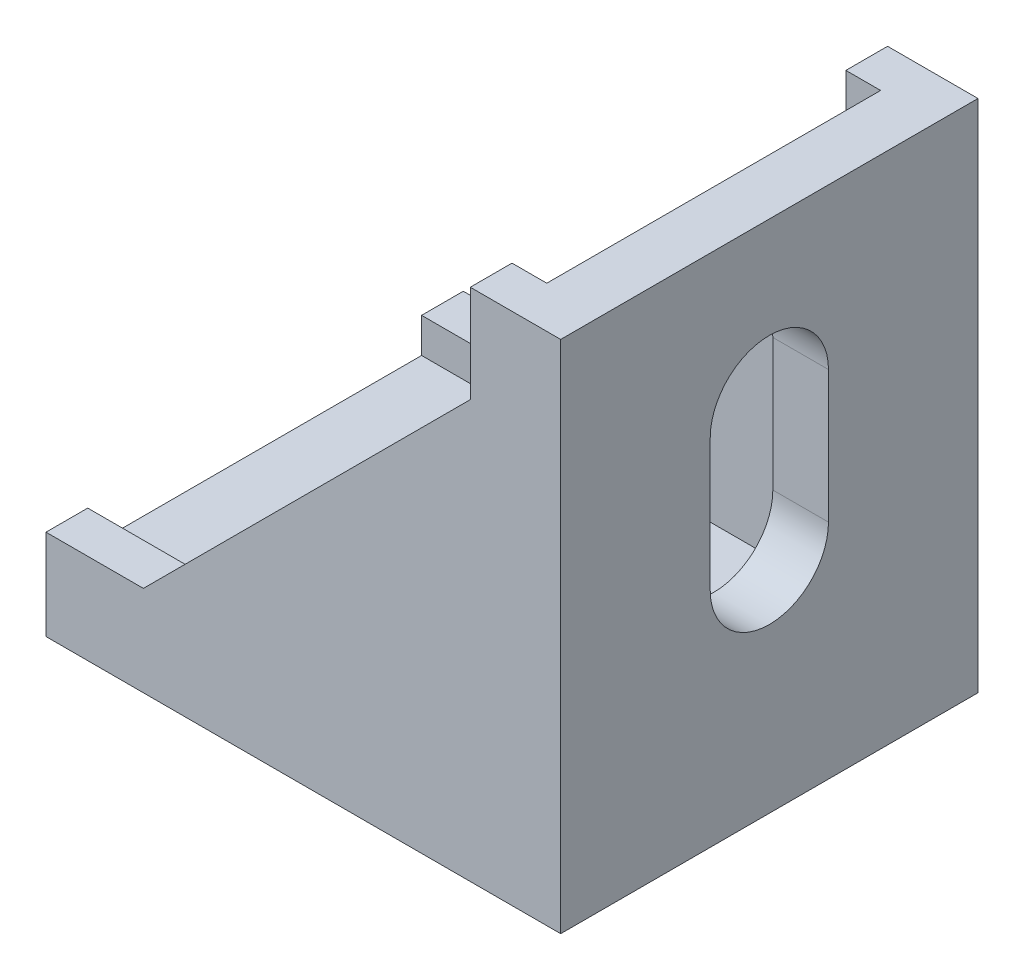
ISO-10303-21;
HEADER;
FILE_DESCRIPTION(('STEP AP214'),'2;1');
FILE_NAME('part.step','',(''),(''),'','','');
FILE_SCHEMA(('AUTOMOTIVE_DESIGN { 1 0 10303 214 1 1 1 1 }'));
ENDSEC;
DATA;
#1=APPLICATION_CONTEXT('core data for automotive mechanical design processes');
#2=APPLICATION_PROTOCOL_DEFINITION('international standard','automotive_design',2000,#1);
#3=PRODUCT_CONTEXT('',#1,'mechanical');
#4=PRODUCT('Part','Part','',(#3));
#5=PRODUCT_RELATED_PRODUCT_CATEGORY('part','',(#4));
#6=PRODUCT_DEFINITION_FORMATION('','',#4);
#7=PRODUCT_DEFINITION_CONTEXT('part definition',#1,'design');
#8=PRODUCT_DEFINITION('design','',#6,#7);
#9=PRODUCT_DEFINITION_SHAPE('','',#8);
#10=(LENGTH_UNIT() NAMED_UNIT(*) SI_UNIT(.MILLI.,.METRE.));
#11=(NAMED_UNIT(*) PLANE_ANGLE_UNIT() SI_UNIT($,.RADIAN.));
#12=(NAMED_UNIT(*) SI_UNIT($,.STERADIAN.) SOLID_ANGLE_UNIT());
#13=UNCERTAINTY_MEASURE_WITH_UNIT(LENGTH_MEASURE(1.E-05),#10,'distance_accuracy_value','');
#14=(GEOMETRIC_REPRESENTATION_CONTEXT(3) GLOBAL_UNCERTAINTY_ASSIGNED_CONTEXT((#13)) GLOBAL_UNIT_ASSIGNED_CONTEXT((#10,
#11,#12)) REPRESENTATION_CONTEXT('',''));
#15=CARTESIAN_POINT('',(0.,0.,0.));
#16=DIRECTION('',(0.,0.,1.));
#17=DIRECTION('',(1.,0.,0.));
#18=AXIS2_PLACEMENT_3D('',#15,#16,#17);
#19=CARTESIAN_POINT('',(16.3392857142857,24.2098214285714,30.));
#20=DIRECTION('',(-1.,0.,0.));
#21=DIRECTION('',(0.,0.,1.));
#22=AXIS2_PLACEMENT_3D('',#19,#20,#21);
#23=PLANE('',#22);
#24=DIRECTION('',(0.,1.,0.));
#25=VECTOR('',#24,1.);
#26=CARTESIAN_POINT('',(16.3392857142857,24.2098214285714,0.));
#27=LINE('',#26,#25);
#28=CARTESIAN_POINT('',(16.3392857142857,-12.7901785714286,0.));
#29=VERTEX_POINT('',#28);
#30=CARTESIAN_POINT('',(16.3392857142857,24.2098214285714,0.));
#31=VERTEX_POINT('',#30);
#32=EDGE_CURVE('E305',#29,#31,#27,.T.);
#33=ORIENTED_EDGE('',*,*,#32,.T.);
#34=DIRECTION('',(0.,0.,-1.));
#35=VECTOR('',#34,1.);
#36=CARTESIAN_POINT('',(16.3392857142857,24.2098214285714,30.));
#37=LINE('',#36,#35);
#38=CARTESIAN_POINT('',(16.3392857142857,24.2098214285714,30.));
#39=VERTEX_POINT('',#38);
#40=EDGE_CURVE('E333',#39,#31,#37,.T.);
#41=ORIENTED_EDGE('',*,*,#40,.F.);
#42=DIRECTION('',(0.,1.,0.));
#43=VECTOR('',#42,1.);
#44=CARTESIAN_POINT('',(16.3392857142857,24.2098214285714,30.));
#45=LINE('',#44,#43);
#46=CARTESIAN_POINT('',(16.3392857142857,-12.7901785714286,30.));
#47=VERTEX_POINT('',#46);
#48=EDGE_CURVE('E290',#47,#39,#45,.T.);
#49=ORIENTED_EDGE('',*,*,#48,.F.);
#50=DIRECTION('',(0.,0.,-1.));
#51=VECTOR('',#50,1.);
#52=CARTESIAN_POINT('',(16.3392857142857,-12.7901785714286,30.));
#53=LINE('',#52,#51);
#54=EDGE_CURVE('E336',#47,#29,#53,.T.);
#55=ORIENTED_EDGE('',*,*,#54,.T.);
#56=EDGE_LOOP('',(#33,#41,#49,#55));
#57=FACE_BOUND('',#56,.T.);
#58=CARTESIAN_POINT('',(16.3392857142861,12.7098214285714,15.));
#59=DIRECTION('',(1.,0.,0.));
#60=DIRECTION('',(0.,1.,0.));
#61=AXIS2_PLACEMENT_3D('',#58,#59,#60);
#62=CIRCLE('',#61,4.25);
#63=CARTESIAN_POINT('',(16.3392857142861,12.7098214285714,10.75));
#64=VERTEX_POINT('',#63);
#65=CARTESIAN_POINT('',(16.3392857142861,12.7098214285714,19.25));
#66=VERTEX_POINT('',#65);
#67=EDGE_CURVE('E183',#64,#66,#62,.T.);
#68=ORIENTED_EDGE('',*,*,#67,.F.);
#69=DIRECTION('',(0.,-1.,0.));
#70=VECTOR('',#69,1.);
#71=CARTESIAN_POINT('',(16.3392857142861,12.7098214285714,10.75));
#72=LINE('',#71,#70);
#73=CARTESIAN_POINT('',(16.3392857142857,3.20982142857137,10.75));
#74=VERTEX_POINT('',#73);
#75=EDGE_CURVE('E189',#64,#74,#72,.T.);
#76=ORIENTED_EDGE('',*,*,#75,.T.);
#77=CARTESIAN_POINT('',(16.339285714286,3.20982142857137,15.));
#78=DIRECTION('',(1.,0.,0.));
#79=DIRECTION('',(0.,1.,0.));
#80=AXIS2_PLACEMENT_3D('',#77,#78,#79);
#81=CIRCLE('',#80,4.25);
#82=CARTESIAN_POINT('',(16.339285714286,3.20982142857137,19.25));
#83=VERTEX_POINT('',#82);
#84=EDGE_CURVE('E193',#83,#74,#81,.T.);
#85=ORIENTED_EDGE('',*,*,#84,.F.);
#86=DIRECTION('',(0.,1.,0.));
#87=VECTOR('',#86,1.);
#88=CARTESIAN_POINT('',(16.339285714286,3.20982142857137,19.25));
#89=LINE('',#88,#87);
#90=EDGE_CURVE('E186',#83,#66,#89,.T.);
#91=ORIENTED_EDGE('',*,*,#90,.T.);
#92=EDGE_LOOP('',(#68,#76,#85,#91));
#93=FACE_BOUND('',#92,.T.);
#94=ADVANCED_FACE('F34',(#57,#93),#23,.F.);
#95=CARTESIAN_POINT('',(12.3392857142857,0.,0.));
#96=DIRECTION('',(-1.,0.,0.));
#97=DIRECTION('',(0.,-1.,0.));
#98=AXIS2_PLACEMENT_3D('',#95,#96,#97);
#99=PLANE('',#98);
#100=DIRECTION('',(0.,0.,-1.));
#101=VECTOR('',#100,1.);
#102=CARTESIAN_POINT('',(12.3392857142857,24.2098214285714,30.));
#103=LINE('',#102,#101);
#104=CARTESIAN_POINT('',(12.3392857142857,24.2098214285714,27.));
#105=VERTEX_POINT('',#104);
#106=CARTESIAN_POINT('',(12.3392857142857,24.2098214285714,2.99999999999999));
#107=VERTEX_POINT('',#106);
#108=EDGE_CURVE('E11',#105,#107,#103,.T.);
#109=ORIENTED_EDGE('',*,*,#108,.T.);
#110=DIRECTION('',(0.,-1.,0.));
#111=VECTOR('',#110,1.);
#112=CARTESIAN_POINT('',(12.3392857142857,26.4399545835836,2.99999999999999));
#113=LINE('',#112,#111);
#114=CARTESIAN_POINT('',(12.3392857142857,-8.79017857142852,3.));
#115=VERTEX_POINT('',#114);
#116=EDGE_CURVE('E246',#107,#115,#113,.T.);
#117=ORIENTED_EDGE('',*,*,#116,.T.);
#118=DIRECTION('',(0.,0.,1.));
#119=VECTOR('',#118,1.);
#120=CARTESIAN_POINT('',(12.3392857142857,-8.79017857142852,3.));
#121=LINE('',#120,#119);
#122=CARTESIAN_POINT('',(12.3392857142857,-8.79017857142851,27.));
#123=VERTEX_POINT('',#122);
#124=EDGE_CURVE('E248',#115,#123,#121,.T.);
#125=ORIENTED_EDGE('',*,*,#124,.T.);
#126=DIRECTION('',(0.,1.,0.));
#127=VECTOR('',#126,1.);
#128=CARTESIAN_POINT('',(12.3392857142857,26.4399545835836,27.));
#129=LINE('',#128,#127);
#130=EDGE_CURVE('E252',#123,#105,#129,.T.);
#131=ORIENTED_EDGE('',*,*,#130,.T.);
#132=EDGE_LOOP('',(#109,#117,#125,#131));
#133=FACE_BOUND('',#132,.T.);
#134=DIRECTION('',(0.,-1.,0.));
#135=VECTOR('',#134,1.);
#136=CARTESIAN_POINT('',(12.3392857142861,12.7098214285714,10.75));
#137=LINE('',#136,#135);
#138=CARTESIAN_POINT('',(12.3392857142857,12.7098214285714,10.75));
#139=VERTEX_POINT('',#138);
#140=CARTESIAN_POINT('',(12.3392857142859,3.20982142857143,10.75));
#141=VERTEX_POINT('',#140);
#142=EDGE_CURVE('E206',#139,#141,#137,.T.);
#143=ORIENTED_EDGE('',*,*,#142,.F.);
#144=CARTESIAN_POINT('',(12.3392857142861,12.7098214285714,15.));
#145=DIRECTION('',(1.,0.,0.));
#146=DIRECTION('',(0.,1.,0.));
#147=AXIS2_PLACEMENT_3D('',#144,#145,#146);
#148=CIRCLE('',#147,4.25);
#149=CARTESIAN_POINT('',(12.3392857142861,12.7098214285714,19.25));
#150=VERTEX_POINT('',#149);
#151=EDGE_CURVE('E57',#139,#150,#148,.T.);
#152=ORIENTED_EDGE('',*,*,#151,.T.);
#153=DIRECTION('',(0.,1.,0.));
#154=VECTOR('',#153,1.);
#155=CARTESIAN_POINT('',(12.3392857142859,3.20982142857143,19.25));
#156=LINE('',#155,#154);
#157=CARTESIAN_POINT('',(12.3392857142859,3.20982142857144,19.25));
#158=VERTEX_POINT('',#157);
#159=EDGE_CURVE('E197',#158,#150,#156,.T.);
#160=ORIENTED_EDGE('',*,*,#159,.F.);
#161=CARTESIAN_POINT('',(12.3392857142859,3.20982142857143,15.));
#162=DIRECTION('',(1.,0.,0.));
#163=DIRECTION('',(0.,1.,0.));
#164=AXIS2_PLACEMENT_3D('',#161,#162,#163);
#165=CIRCLE('',#164,4.25);
#166=EDGE_CURVE('E200',#158,#141,#165,.T.);
#167=ORIENTED_EDGE('',*,*,#166,.T.);
#168=EDGE_LOOP('',(#143,#152,#160,#167));
#169=FACE_BOUND('',#168,.T.);
#170=ADVANCED_FACE('F374',(#133,#169),#99,.T.);
#171=CARTESIAN_POINT('',(9.83928571428571,24.2098214285714,30.));
#172=DIRECTION('',(1.,0.,0.));
#173=DIRECTION('',(0.,1.,0.));
#174=AXIS2_PLACEMENT_3D('',#171,#172,#173);
#175=PLANE('',#174);
#176=DIRECTION('',(0.,0.,-1.));
#177=VECTOR('',#176,1.);
#178=CARTESIAN_POINT('',(9.83928571428572,17.2098214285714,30.));
#179=LINE('',#178,#177);
#180=CARTESIAN_POINT('',(9.83928571428572,17.2098214285714,2.99999999999999));
#181=VERTEX_POINT('',#180);
#182=CARTESIAN_POINT('',(9.83928571428572,17.2098214285714,0.));
#183=VERTEX_POINT('',#182);
#184=EDGE_CURVE('E325',#181,#183,#179,.T.);
#185=ORIENTED_EDGE('',*,*,#184,.F.);
#186=DIRECTION('',(0.,1.,0.));
#187=VECTOR('',#186,1.);
#188=CARTESIAN_POINT('',(9.83928571428571,24.2098214285714,2.99999999999999));
#189=LINE('',#188,#187);
#190=CARTESIAN_POINT('',(9.83928571428571,24.2098214285714,2.99999999999999));
#191=VERTEX_POINT('',#190);
#192=EDGE_CURVE('E277',#181,#191,#189,.T.);
#193=ORIENTED_EDGE('',*,*,#192,.T.);
#194=DIRECTION('',(0.,0.,-1.));
#195=VECTOR('',#194,1.);
#196=CARTESIAN_POINT('',(9.83928571428571,24.2098214285714,30.));
#197=LINE('',#196,#195);
#198=CARTESIAN_POINT('',(9.83928571428571,24.2098214285714,0.));
#199=VERTEX_POINT('',#198);
#200=EDGE_CURVE('E329',#191,#199,#197,.T.);
#201=ORIENTED_EDGE('',*,*,#200,.T.);
#202=DIRECTION('',(0.,-1.,0.));
#203=VECTOR('',#202,1.);
#204=CARTESIAN_POINT('',(9.83928571428571,24.2098214285714,0.));
#205=LINE('',#204,#203);
#206=EDGE_CURVE('E310',#199,#183,#205,.T.);
#207=ORIENTED_EDGE('',*,*,#206,.T.);
#208=EDGE_LOOP('',(#185,#193,#201,#207));
#209=FACE_BOUND('',#208,.T.);
#210=ADVANCED_FACE('F382',(#209),#175,.F.);
#211=CARTESIAN_POINT('',(-13.6607142857143,-6.29017857142856,30.));
#212=DIRECTION('',(0.707106781186547,-0.707106781186548,0.));
#213=DIRECTION('',(0.707106781186548,0.707106781186547,0.));
#214=AXIS2_PLACEMENT_3D('',#211,#212,#213);
#215=PLANE('',#214);
#216=DIRECTION('',(0.,0.,-1.));
#217=VECTOR('',#216,1.);
#218=CARTESIAN_POINT('',(-13.6607142857143,-6.29017857142856,30.));
#219=LINE('',#218,#217);
#220=CARTESIAN_POINT('',(-13.6607142857143,-6.29017857142856,3.));
#221=VERTEX_POINT('',#220);
#222=CARTESIAN_POINT('',(-13.6607142857143,-6.29017857142856,0.));
#223=VERTEX_POINT('',#222);
#224=EDGE_CURVE('E321',#221,#223,#219,.T.);
#225=ORIENTED_EDGE('',*,*,#224,.F.);
#226=DIRECTION('',(0.707106781186548,0.707106781186547,0.));
#227=VECTOR('',#226,1.);
#228=CARTESIAN_POINT('',(-13.6607142857143,-6.29017857142857,3.));
#229=LINE('',#228,#227);
#230=EDGE_CURVE('E274',#221,#181,#229,.T.);
#231=ORIENTED_EDGE('',*,*,#230,.T.);
#232=ORIENTED_EDGE('',*,*,#184,.T.);
#233=DIRECTION('',(-0.707106781186548,-0.707106781186547,0.));
#234=VECTOR('',#233,1.);
#235=CARTESIAN_POINT('',(-13.6607142857143,-6.29017857142856,0.));
#236=LINE('',#235,#234);
#237=EDGE_CURVE('E313',#183,#223,#236,.T.);
#238=ORIENTED_EDGE('',*,*,#237,.T.);
#239=EDGE_LOOP('',(#225,#231,#232,#238));
#240=FACE_BOUND('',#239,.T.);
#241=ADVANCED_FACE('F352',(#240),#215,.F.);
#242=CARTESIAN_POINT('',(-20.6607142857143,-6.29017857142856,30.));
#243=DIRECTION('',(0.,-1.,0.));
#244=DIRECTION('',(1.,0.,0.));
#245=AXIS2_PLACEMENT_3D('',#242,#243,#244);
#246=PLANE('',#245);
#247=DIRECTION('',(0.,0.,-1.));
#248=VECTOR('',#247,1.);
#249=CARTESIAN_POINT('',(-20.6607142857143,-6.29017857142856,30.));
#250=LINE('',#249,#248);
#251=CARTESIAN_POINT('',(-20.6607142857143,-6.29017857142856,3.));
#252=VERTEX_POINT('',#251);
#253=CARTESIAN_POINT('',(-20.6607142857143,-6.29017857142856,0.));
#254=VERTEX_POINT('',#253);
#255=EDGE_CURVE('E300',#252,#254,#250,.T.);
#256=ORIENTED_EDGE('',*,*,#255,.F.);
#257=DIRECTION('',(1.,0.,0.));
#258=VECTOR('',#257,1.);
#259=CARTESIAN_POINT('',(-20.6607142857143,-6.29017857142856,3.));
#260=LINE('',#259,#258);
#261=EDGE_CURVE('E42',#252,#221,#260,.T.);
#262=ORIENTED_EDGE('',*,*,#261,.T.);
#263=ORIENTED_EDGE('',*,*,#224,.T.);
#264=DIRECTION('',(-1.,0.,0.));
#265=VECTOR('',#264,1.);
#266=CARTESIAN_POINT('',(-20.6607142857143,-6.29017857142856,0.));
#267=LINE('',#266,#265);
#268=EDGE_CURVE('E288',#223,#254,#267,.T.);
#269=ORIENTED_EDGE('',*,*,#268,.T.);
#270=EDGE_LOOP('',(#256,#262,#263,#269));
#271=FACE_BOUND('',#270,.T.);
#272=ADVANCED_FACE('F348',(#271),#246,.F.);
#273=CARTESIAN_POINT('',(-20.6607142857143,-12.7901785714286,30.));
#274=DIRECTION('',(1.,0.,0.));
#275=DIRECTION('',(0.,1.,0.));
#276=AXIS2_PLACEMENT_3D('',#273,#274,#275);
#277=PLANE('',#276);
#278=DIRECTION('',(0.,0.,1.));
#279=VECTOR('',#278,1.);
#280=CARTESIAN_POINT('',(-20.6607142857143,-8.79017857142857,3.));
#281=LINE('',#280,#279);
#282=CARTESIAN_POINT('',(-20.6607142857143,-8.79017857142857,3.));
#283=VERTEX_POINT('',#282);
#284=CARTESIAN_POINT('',(-20.6607142857143,-8.79017857142857,27.));
#285=VERTEX_POINT('',#284);
#286=EDGE_CURVE('E257',#283,#285,#281,.T.);
#287=ORIENTED_EDGE('',*,*,#286,.F.);
#288=DIRECTION('',(0.,-1.,0.));
#289=VECTOR('',#288,1.);
#290=CARTESIAN_POINT('',(-20.6607142857143,26.4399545835836,2.99999999999999));
#291=LINE('',#290,#289);
#292=EDGE_CURVE('E239',#252,#283,#291,.T.);
#293=ORIENTED_EDGE('',*,*,#292,.F.);
#294=ORIENTED_EDGE('',*,*,#255,.T.);
#295=DIRECTION('',(0.,-1.,0.));
#296=VECTOR('',#295,1.);
#297=CARTESIAN_POINT('',(-20.6607142857143,-12.7901785714286,0.));
#298=LINE('',#297,#296);
#299=CARTESIAN_POINT('',(-20.6607142857143,-12.7901785714286,0.));
#300=VERTEX_POINT('',#299);
#301=EDGE_CURVE('E283',#254,#300,#298,.T.);
#302=ORIENTED_EDGE('',*,*,#301,.T.);
#303=DIRECTION('',(0.,0.,-1.));
#304=VECTOR('',#303,1.);
#305=CARTESIAN_POINT('',(-20.6607142857143,-12.7901785714286,30.));
#306=LINE('',#305,#304);
#307=CARTESIAN_POINT('',(-20.6607142857143,-12.7901785714286,30.));
#308=VERTEX_POINT('',#307);
#309=EDGE_CURVE('E339',#308,#300,#306,.T.);
#310=ORIENTED_EDGE('',*,*,#309,.F.);
#311=DIRECTION('',(0.,-1.,0.));
#312=VECTOR('',#311,1.);
#313=CARTESIAN_POINT('',(-20.6607142857143,-12.7901785714286,30.));
#314=LINE('',#313,#312);
#315=CARTESIAN_POINT('',(-20.6607142857143,-6.29017857142856,30.));
#316=VERTEX_POINT('',#315);
#317=EDGE_CURVE('E284',#316,#308,#314,.T.);
#318=ORIENTED_EDGE('',*,*,#317,.F.);
#319=CARTESIAN_POINT('',(-20.6607142857143,-6.29017857142856,27.));
#320=VERTEX_POINT('',#319);
#321=EDGE_CURVE('E318',#316,#320,#250,.T.);
#322=ORIENTED_EDGE('',*,*,#321,.T.);
#323=DIRECTION('',(0.,1.,0.));
#324=VECTOR('',#323,1.);
#325=CARTESIAN_POINT('',(-20.6607142857143,26.4399545835836,27.));
#326=LINE('',#325,#324);
#327=EDGE_CURVE('E249',#285,#320,#326,.T.);
#328=ORIENTED_EDGE('',*,*,#327,.F.);
#329=EDGE_LOOP('',(#287,#293,#294,#302,#310,#318,#322,#328));
#330=FACE_BOUND('',#329,.T.);
#331=ADVANCED_FACE('F36',(#330),#277,.F.);
#332=CARTESIAN_POINT('',(-20.6607142857143,-12.7901785714286,30.));
#333=DIRECTION('',(0.,1.,0.));
#334=DIRECTION('',(0.,0.,1.));
#335=AXIS2_PLACEMENT_3D('',#332,#333,#334);
#336=PLANE('',#335);
#337=DIRECTION('',(1.,0.,0.));
#338=VECTOR('',#337,1.);
#339=CARTESIAN_POINT('',(-9.16071428571423,-12.7901785714286,10.75));
#340=LINE('',#339,#338);
#341=CARTESIAN_POINT('',(-9.16071428571423,-12.7901785714286,10.75));
#342=VERTEX_POINT('',#341);
#343=CARTESIAN_POINT('',(0.339285714285771,-12.7901785714286,10.75));
#344=VERTEX_POINT('',#343);
#345=EDGE_CURVE('E225',#342,#344,#340,.T.);
#346=ORIENTED_EDGE('',*,*,#345,.F.);
#347=CARTESIAN_POINT('',(-9.16071428571423,-12.7901785714286,15.));
#348=DIRECTION('',(0.,1.,0.));
#349=DIRECTION('',(-1.,0.,0.));
#350=AXIS2_PLACEMENT_3D('',#347,#348,#349);
#351=CIRCLE('',#350,4.25);
#352=CARTESIAN_POINT('',(-9.16071428571423,-12.7901785714286,19.25));
#353=VERTEX_POINT('',#352);
#354=EDGE_CURVE('E216',#342,#353,#351,.T.);
#355=ORIENTED_EDGE('',*,*,#354,.T.);
#356=DIRECTION('',(-1.,0.,0.));
#357=VECTOR('',#356,1.);
#358=CARTESIAN_POINT('',(0.339285714285771,-12.7901785714286,19.25));
#359=LINE('',#358,#357);
#360=CARTESIAN_POINT('',(0.339285714285768,-12.7901785714286,19.25));
#361=VERTEX_POINT('',#360);
#362=EDGE_CURVE('E219',#361,#353,#359,.T.);
#363=ORIENTED_EDGE('',*,*,#362,.F.);
#364=CARTESIAN_POINT('',(0.339285714285771,-12.7901785714286,15.));
#365=DIRECTION('',(0.,1.,0.));
#366=DIRECTION('',(-1.,0.,0.));
#367=AXIS2_PLACEMENT_3D('',#364,#365,#366);
#368=CIRCLE('',#367,4.25);
#369=EDGE_CURVE('E222',#361,#344,#368,.T.);
#370=ORIENTED_EDGE('',*,*,#369,.T.);
#371=EDGE_LOOP('',(#346,#355,#363,#370));
#372=FACE_BOUND('',#371,.T.);
#373=DIRECTION('',(1.,0.,0.));
#374=VECTOR('',#373,1.);
#375=CARTESIAN_POINT('',(-20.6607142857143,-12.7901785714286,0.));
#376=LINE('',#375,#374);
#377=EDGE_CURVE('E303',#300,#29,#376,.T.);
#378=ORIENTED_EDGE('',*,*,#377,.T.);
#379=ORIENTED_EDGE('',*,*,#54,.F.);
#380=DIRECTION('',(1.,0.,0.));
#381=VECTOR('',#380,1.);
#382=CARTESIAN_POINT('',(-20.6607142857143,-12.7901785714286,30.));
#383=LINE('',#382,#381);
#384=EDGE_CURVE('E287',#308,#47,#383,.T.);
#385=ORIENTED_EDGE('',*,*,#384,.F.);
#386=ORIENTED_EDGE('',*,*,#309,.T.);
#387=EDGE_LOOP('',(#378,#379,#385,#386));
#388=FACE_BOUND('',#387,.T.);
#389=ADVANCED_FACE('F394',(#372,#388),#336,.F.);
#390=CARTESIAN_POINT('',(16.3392857142857,24.2098214285714,30.));
#391=DIRECTION('',(0.,-1.,0.));
#392=DIRECTION('',(0.,0.,-1.));
#393=AXIS2_PLACEMENT_3D('',#390,#391,#392);
#394=PLANE('',#393);
#395=ORIENTED_EDGE('',*,*,#200,.F.);
#396=DIRECTION('',(1.,0.,0.));
#397=VECTOR('',#396,1.);
#398=CARTESIAN_POINT('',(16.3392857142857,24.2098214285714,2.99999999999999));
#399=LINE('',#398,#397);
#400=EDGE_CURVE('E280',#191,#107,#399,.T.);
#401=ORIENTED_EDGE('',*,*,#400,.T.);
#402=ORIENTED_EDGE('',*,*,#108,.F.);
#403=DIRECTION('',(-1.,0.,0.));
#404=VECTOR('',#403,1.);
#405=CARTESIAN_POINT('',(16.3392857142857,24.2098214285714,27.));
#406=LINE('',#405,#404);
#407=CARTESIAN_POINT('',(9.83928571428571,24.2098214285714,27.));
#408=VERTEX_POINT('',#407);
#409=EDGE_CURVE('E271',#105,#408,#406,.T.);
#410=ORIENTED_EDGE('',*,*,#409,.T.);
#411=CARTESIAN_POINT('',(9.83928571428571,24.2098214285714,30.));
#412=VERTEX_POINT('',#411);
#413=EDGE_CURVE('E330',#412,#408,#197,.T.);
#414=ORIENTED_EDGE('',*,*,#413,.F.);
#415=DIRECTION('',(-1.,0.,0.));
#416=VECTOR('',#415,1.);
#417=CARTESIAN_POINT('',(16.3392857142857,24.2098214285714,30.));
#418=LINE('',#417,#416);
#419=EDGE_CURVE('E292',#39,#412,#418,.T.);
#420=ORIENTED_EDGE('',*,*,#419,.F.);
#421=ORIENTED_EDGE('',*,*,#40,.T.);
#422=DIRECTION('',(-1.,0.,0.));
#423=VECTOR('',#422,1.);
#424=CARTESIAN_POINT('',(16.3392857142857,24.2098214285714,0.));
#425=LINE('',#424,#423);
#426=EDGE_CURVE('E307',#31,#199,#425,.T.);
#427=ORIENTED_EDGE('',*,*,#426,.T.);
#428=EDGE_LOOP('',(#395,#401,#402,#410,#414,#420,#421,#427));
#429=FACE_BOUND('',#428,.T.);
#430=ADVANCED_FACE('F379',(#429),#394,.F.);
#431=ORIENTED_EDGE('',*,*,#413,.T.);
#432=DIRECTION('',(0.,-1.,0.));
#433=VECTOR('',#432,1.);
#434=CARTESIAN_POINT('',(9.83928571428571,24.2098214285714,27.));
#435=LINE('',#434,#433);
#436=CARTESIAN_POINT('',(9.83928571428572,17.2098214285714,27.));
#437=VERTEX_POINT('',#436);
#438=EDGE_CURVE('E268',#408,#437,#435,.T.);
#439=ORIENTED_EDGE('',*,*,#438,.T.);
#440=CARTESIAN_POINT('',(9.83928571428572,17.2098214285714,30.));
#441=VERTEX_POINT('',#440);
#442=EDGE_CURVE('E326',#441,#437,#179,.T.);
#443=ORIENTED_EDGE('',*,*,#442,.F.);
#444=DIRECTION('',(0.,-1.,0.));
#445=VECTOR('',#444,1.);
#446=CARTESIAN_POINT('',(9.83928571428571,24.2098214285714,30.));
#447=LINE('',#446,#445);
#448=EDGE_CURVE('E294',#412,#441,#447,.T.);
#449=ORIENTED_EDGE('',*,*,#448,.F.);
#450=EDGE_LOOP('',(#431,#439,#443,#449));
#451=FACE_BOUND('',#450,.T.);
#452=ADVANCED_FACE('F401',(#451),#175,.F.);
#453=ORIENTED_EDGE('',*,*,#442,.T.);
#454=DIRECTION('',(-0.707106781186548,-0.707106781186547,0.));
#455=VECTOR('',#454,1.);
#456=CARTESIAN_POINT('',(-13.6607142857143,-6.29017857142856,27.));
#457=LINE('',#456,#455);
#458=CARTESIAN_POINT('',(-13.6607142857143,-6.29017857142856,27.));
#459=VERTEX_POINT('',#458);
#460=EDGE_CURVE('E263',#437,#459,#457,.T.);
#461=ORIENTED_EDGE('',*,*,#460,.T.);
#462=CARTESIAN_POINT('',(-13.6607142857143,-6.29017857142856,30.));
#463=VERTEX_POINT('',#462);
#464=EDGE_CURVE('E322',#463,#459,#219,.T.);
#465=ORIENTED_EDGE('',*,*,#464,.F.);
#466=DIRECTION('',(-0.707106781186548,-0.707106781186547,0.));
#467=VECTOR('',#466,1.);
#468=CARTESIAN_POINT('',(-13.6607142857143,-6.29017857142856,30.));
#469=LINE('',#468,#467);
#470=EDGE_CURVE('E296',#441,#463,#469,.T.);
#471=ORIENTED_EDGE('',*,*,#470,.F.);
#472=EDGE_LOOP('',(#453,#461,#465,#471));
#473=FACE_BOUND('',#472,.T.);
#474=ADVANCED_FACE('F413',(#473),#215,.F.);
#475=ORIENTED_EDGE('',*,*,#464,.T.);
#476=DIRECTION('',(-1.,0.,0.));
#477=VECTOR('',#476,1.);
#478=CARTESIAN_POINT('',(-20.6607142857143,-6.29017857142856,27.));
#479=LINE('',#478,#477);
#480=EDGE_CURVE('E342',#459,#320,#479,.T.);
#481=ORIENTED_EDGE('',*,*,#480,.T.);
#482=ORIENTED_EDGE('',*,*,#321,.F.);
#483=DIRECTION('',(-1.,0.,0.));
#484=VECTOR('',#483,1.);
#485=CARTESIAN_POINT('',(-20.6607142857143,-6.29017857142856,30.));
#486=LINE('',#485,#484);
#487=EDGE_CURVE('E298',#463,#316,#486,.T.);
#488=ORIENTED_EDGE('',*,*,#487,.F.);
#489=EDGE_LOOP('',(#475,#481,#482,#488));
#490=FACE_BOUND('',#489,.T.);
#491=ADVANCED_FACE('F417',(#490),#246,.F.);
#492=CARTESIAN_POINT('',(0.,0.,30.));
#493=DIRECTION('',(0.,0.,-1.));
#494=DIRECTION('',(-1.,0.,0.));
#495=AXIS2_PLACEMENT_3D('',#492,#493,#494);
#496=PLANE('',#495);
#497=ORIENTED_EDGE('',*,*,#317,.T.);
#498=ORIENTED_EDGE('',*,*,#384,.T.);
#499=ORIENTED_EDGE('',*,*,#48,.T.);
#500=ORIENTED_EDGE('',*,*,#419,.T.);
#501=ORIENTED_EDGE('',*,*,#448,.T.);
#502=ORIENTED_EDGE('',*,*,#470,.T.);
#503=ORIENTED_EDGE('',*,*,#487,.T.);
#504=EDGE_LOOP('',(#497,#498,#499,#500,#501,#502,#503));
#505=FACE_BOUND('',#504,.T.);
#506=ADVANCED_FACE('F391',(#505),#496,.F.);
#507=CARTESIAN_POINT('',(0.,0.,0.));
#508=DIRECTION('',(0.,0.,-1.));
#509=DIRECTION('',(-1.,0.,0.));
#510=AXIS2_PLACEMENT_3D('',#507,#508,#509);
#511=PLANE('',#510);
#512=ORIENTED_EDGE('',*,*,#301,.F.);
#513=ORIENTED_EDGE('',*,*,#268,.F.);
#514=ORIENTED_EDGE('',*,*,#237,.F.);
#515=ORIENTED_EDGE('',*,*,#206,.F.);
#516=ORIENTED_EDGE('',*,*,#426,.F.);
#517=ORIENTED_EDGE('',*,*,#32,.F.);
#518=ORIENTED_EDGE('',*,*,#377,.F.);
#519=EDGE_LOOP('',(#512,#513,#514,#515,#516,#517,#518));
#520=FACE_BOUND('',#519,.T.);
#521=ADVANCED_FACE('F359',(#520),#511,.T.);
#522=CARTESIAN_POINT('',(12.3392857142857,26.4399545835836,2.99999999999999));
#523=DIRECTION('',(0.,0.,-1.));
#524=DIRECTION('',(0.,1.,0.));
#525=AXIS2_PLACEMENT_3D('',#522,#523,#524);
#526=PLANE('',#525);
#527=ORIENTED_EDGE('',*,*,#192,.F.);
#528=ORIENTED_EDGE('',*,*,#230,.F.);
#529=ORIENTED_EDGE('',*,*,#261,.F.);
#530=ORIENTED_EDGE('',*,*,#292,.T.);
#531=DIRECTION('',(-1.,0.,0.));
#532=VECTOR('',#531,1.);
#533=CARTESIAN_POINT('',(12.3392857142857,-8.79017857142852,3.));
#534=LINE('',#533,#532);
#535=EDGE_CURVE('E255',#115,#283,#534,.T.);
#536=ORIENTED_EDGE('',*,*,#535,.F.);
#537=ORIENTED_EDGE('',*,*,#116,.F.);
#538=ORIENTED_EDGE('',*,*,#400,.F.);
#539=EDGE_LOOP('',(#527,#528,#529,#530,#536,#537,#538));
#540=FACE_BOUND('',#539,.T.);
#541=ADVANCED_FACE('F367',(#540),#526,.F.);
#542=CARTESIAN_POINT('',(12.3392857142857,26.4399545835836,27.));
#543=DIRECTION('',(0.,0.,1.));
#544=DIRECTION('',(0.,-1.,0.));
#545=AXIS2_PLACEMENT_3D('',#542,#543,#544);
#546=PLANE('',#545);
#547=ORIENTED_EDGE('',*,*,#130,.F.);
#548=DIRECTION('',(-1.,0.,0.));
#549=VECTOR('',#548,1.);
#550=CARTESIAN_POINT('',(12.3392857142857,-8.79017857142851,27.));
#551=LINE('',#550,#549);
#552=EDGE_CURVE('E261',#123,#285,#551,.T.);
#553=ORIENTED_EDGE('',*,*,#552,.T.);
#554=ORIENTED_EDGE('',*,*,#327,.T.);
#555=ORIENTED_EDGE('',*,*,#480,.F.);
#556=ORIENTED_EDGE('',*,*,#460,.F.);
#557=ORIENTED_EDGE('',*,*,#438,.F.);
#558=ORIENTED_EDGE('',*,*,#409,.F.);
#559=EDGE_LOOP('',(#547,#553,#554,#555,#556,#557,#558));
#560=FACE_BOUND('',#559,.T.);
#561=ADVANCED_FACE('F428',(#560),#546,.F.);
#562=CARTESIAN_POINT('',(12.3392857142857,-8.79017857142852,3.));
#563=DIRECTION('',(0.,-1.,0.));
#564=DIRECTION('',(1.,0.,0.));
#565=AXIS2_PLACEMENT_3D('',#562,#563,#564);
#566=PLANE('',#565);
#567=DIRECTION('',(-1.,0.,0.));
#568=VECTOR('',#567,1.);
#569=CARTESIAN_POINT('',(0.339285714285764,-8.79017857142853,19.25));
#570=LINE('',#569,#568);
#571=CARTESIAN_POINT('',(0.339285714285764,-8.79017857142853,19.25));
#572=VERTEX_POINT('',#571);
#573=CARTESIAN_POINT('',(-9.16071428571423,-8.79017857142855,19.25));
#574=VERTEX_POINT('',#573);
#575=EDGE_CURVE('E229',#572,#574,#570,.T.);
#576=ORIENTED_EDGE('',*,*,#575,.T.);
#577=CARTESIAN_POINT('',(-9.16071428571423,-8.79017857142855,15.));
#578=DIRECTION('',(0.,1.,0.));
#579=DIRECTION('',(-1.,0.,0.));
#580=AXIS2_PLACEMENT_3D('',#577,#578,#579);
#581=CIRCLE('',#580,4.25);
#582=CARTESIAN_POINT('',(-9.16071428571423,-8.79017857142855,10.75));
#583=VERTEX_POINT('',#582);
#584=EDGE_CURVE('E212',#583,#574,#581,.T.);
#585=ORIENTED_EDGE('',*,*,#584,.F.);
#586=DIRECTION('',(1.,0.,0.));
#587=VECTOR('',#586,1.);
#588=CARTESIAN_POINT('',(-9.16071428571423,-8.79017857142855,10.75));
#589=LINE('',#588,#587);
#590=CARTESIAN_POINT('',(0.339285714285764,-8.79017857142853,10.75));
#591=VERTEX_POINT('',#590);
#592=EDGE_CURVE('E220',#583,#591,#589,.T.);
#593=ORIENTED_EDGE('',*,*,#592,.T.);
#594=CARTESIAN_POINT('',(0.339285714285764,-8.79017857142853,15.));
#595=DIRECTION('',(0.,1.,0.));
#596=DIRECTION('',(-1.,0.,0.));
#597=AXIS2_PLACEMENT_3D('',#594,#595,#596);
#598=CIRCLE('',#597,4.25);
#599=EDGE_CURVE('E232',#572,#591,#598,.T.);
#600=ORIENTED_EDGE('',*,*,#599,.F.);
#601=EDGE_LOOP('',(#576,#585,#593,#600));
#602=FACE_BOUND('',#601,.T.);
#603=ORIENTED_EDGE('',*,*,#286,.T.);
#604=ORIENTED_EDGE('',*,*,#552,.F.);
#605=ORIENTED_EDGE('',*,*,#124,.F.);
#606=ORIENTED_EDGE('',*,*,#535,.T.);
#607=EDGE_LOOP('',(#603,#604,#605,#606));
#608=FACE_BOUND('',#607,.T.);
#609=ADVANCED_FACE('F371',(#602,#608),#566,.F.);
#610=CARTESIAN_POINT('',(-9.16071428571423,-12.7901785714286,15.));
#611=DIRECTION('',(0.,1.,0.));
#612=DIRECTION('',(-1.,0.,0.));
#613=AXIS2_PLACEMENT_3D('',#610,#611,#612);
#614=CYLINDRICAL_SURFACE('',#613,4.25);
#615=ORIENTED_EDGE('',*,*,#584,.T.);
#616=DIRECTION('',(0.,1.,0.));
#617=VECTOR('',#616,1.);
#618=CARTESIAN_POINT('',(-9.16071428571423,-12.7901785714286,19.25));
#619=LINE('',#618,#617);
#620=EDGE_CURVE('E227',#353,#574,#619,.T.);
#621=ORIENTED_EDGE('',*,*,#620,.F.);
#622=ORIENTED_EDGE('',*,*,#354,.F.);
#623=DIRECTION('',(0.,1.,0.));
#624=VECTOR('',#623,1.);
#625=CARTESIAN_POINT('',(-9.16071428571423,-12.7901785714286,10.75));
#626=LINE('',#625,#624);
#627=EDGE_CURVE('E237',#342,#583,#626,.T.);
#628=ORIENTED_EDGE('',*,*,#627,.T.);
#629=EDGE_LOOP('',(#615,#621,#622,#628));
#630=FACE_BOUND('',#629,.T.);
#631=ADVANCED_FACE('F431',(#630),#614,.F.);
#632=CARTESIAN_POINT('',(-9.16071428571423,-12.7901785714286,10.75));
#633=DIRECTION('',(0.,0.,1.));
#634=DIRECTION('',(0.,-1.,0.));
#635=AXIS2_PLACEMENT_3D('',#632,#633,#634);
#636=PLANE('',#635);
#637=ORIENTED_EDGE('',*,*,#592,.F.);
#638=ORIENTED_EDGE('',*,*,#627,.F.);
#639=ORIENTED_EDGE('',*,*,#345,.T.);
#640=DIRECTION('',(0.,1.,0.));
#641=VECTOR('',#640,1.);
#642=CARTESIAN_POINT('',(0.339285714285771,-12.7901785714286,10.75));
#643=LINE('',#642,#641);
#644=EDGE_CURVE('E240',#344,#591,#643,.T.);
#645=ORIENTED_EDGE('',*,*,#644,.T.);
#646=EDGE_LOOP('',(#637,#638,#639,#645));
#647=FACE_BOUND('',#646,.T.);
#648=ADVANCED_FACE('F438',(#647),#636,.T.);
#649=CARTESIAN_POINT('',(0.339285714285771,-12.7901785714286,15.));
#650=DIRECTION('',(0.,1.,0.));
#651=DIRECTION('',(-1.,0.,0.));
#652=AXIS2_PLACEMENT_3D('',#649,#650,#651);
#653=CYLINDRICAL_SURFACE('',#652,4.25);
#654=ORIENTED_EDGE('',*,*,#599,.T.);
#655=ORIENTED_EDGE('',*,*,#644,.F.);
#656=ORIENTED_EDGE('',*,*,#369,.F.);
#657=DIRECTION('',(0.,1.,0.));
#658=VECTOR('',#657,1.);
#659=CARTESIAN_POINT('',(0.33928571428577,-12.7901785714286,19.25));
#660=LINE('',#659,#658);
#661=EDGE_CURVE('E242',#361,#572,#660,.T.);
#662=ORIENTED_EDGE('',*,*,#661,.T.);
#663=EDGE_LOOP('',(#654,#655,#656,#662));
#664=FACE_BOUND('',#663,.T.);
#665=ADVANCED_FACE('F443',(#664),#653,.F.);
#666=CARTESIAN_POINT('',(0.339285714285771,-12.7901785714286,19.25));
#667=DIRECTION('',(0.,0.,-1.));
#668=DIRECTION('',(0.,1.,0.));
#669=AXIS2_PLACEMENT_3D('',#666,#667,#668);
#670=PLANE('',#669);
#671=ORIENTED_EDGE('',*,*,#575,.F.);
#672=ORIENTED_EDGE('',*,*,#661,.F.);
#673=ORIENTED_EDGE('',*,*,#362,.T.);
#674=ORIENTED_EDGE('',*,*,#620,.T.);
#675=EDGE_LOOP('',(#671,#672,#673,#674));
#676=FACE_BOUND('',#675,.T.);
#677=ADVANCED_FACE('F440',(#676),#670,.T.);
#678=CARTESIAN_POINT('',(16.3392857142861,12.7098214285714,15.));
#679=DIRECTION('',(-1.,0.,0.));
#680=DIRECTION('',(0.,-1.,0.));
#681=AXIS2_PLACEMENT_3D('',#678,#679,#680);
#682=CYLINDRICAL_SURFACE('',#681,4.25);
#683=ORIENTED_EDGE('',*,*,#151,.F.);
#684=DIRECTION('',(-1.,0.,0.));
#685=VECTOR('',#684,1.);
#686=CARTESIAN_POINT('',(16.3392857142861,12.7098214285714,10.75));
#687=LINE('',#686,#685);
#688=EDGE_CURVE('E180',#64,#139,#687,.T.);
#689=ORIENTED_EDGE('',*,*,#688,.F.);
#690=ORIENTED_EDGE('',*,*,#67,.T.);
#691=DIRECTION('',(-1.,0.,0.));
#692=VECTOR('',#691,1.);
#693=CARTESIAN_POINT('',(16.3392857142861,12.7098214285714,19.25));
#694=LINE('',#693,#692);
#695=EDGE_CURVE('E210',#66,#150,#694,.T.);
#696=ORIENTED_EDGE('',*,*,#695,.T.);
#697=EDGE_LOOP('',(#683,#689,#690,#696));
#698=FACE_BOUND('',#697,.T.);
#699=ADVANCED_FACE('F181',(#698),#682,.F.);
#700=CARTESIAN_POINT('',(16.339285714286,3.20982142857137,19.25));
#701=DIRECTION('',(0.,0.,1.));
#702=DIRECTION('',(0.,-1.,0.));
#703=AXIS2_PLACEMENT_3D('',#700,#701,#702);
#704=PLANE('',#703);
#705=ORIENTED_EDGE('',*,*,#159,.T.);
#706=ORIENTED_EDGE('',*,*,#695,.F.);
#707=ORIENTED_EDGE('',*,*,#90,.F.);
#708=DIRECTION('',(-1.,0.,0.));
#709=VECTOR('',#708,1.);
#710=CARTESIAN_POINT('',(16.339285714286,3.20982142857137,19.25));
#711=LINE('',#710,#709);
#712=EDGE_CURVE('E213',#83,#158,#711,.T.);
#713=ORIENTED_EDGE('',*,*,#712,.T.);
#714=EDGE_LOOP('',(#705,#706,#707,#713));
#715=FACE_BOUND('',#714,.T.);
#716=ADVANCED_FACE('F453',(#715),#704,.F.);
#717=CARTESIAN_POINT('',(16.339285714286,3.20982142857137,15.));
#718=DIRECTION('',(-1.,0.,0.));
#719=DIRECTION('',(0.,-1.,0.));
#720=AXIS2_PLACEMENT_3D('',#717,#718,#719);
#721=CYLINDRICAL_SURFACE('',#720,4.25);
#722=ORIENTED_EDGE('',*,*,#166,.F.);
#723=ORIENTED_EDGE('',*,*,#712,.F.);
#724=ORIENTED_EDGE('',*,*,#84,.T.);
#725=DIRECTION('',(-1.,0.,0.));
#726=VECTOR('',#725,1.);
#727=CARTESIAN_POINT('',(16.339285714286,3.20982142857137,10.75));
#728=LINE('',#727,#726);
#729=EDGE_CURVE('E49',#74,#141,#728,.T.);
#730=ORIENTED_EDGE('',*,*,#729,.T.);
#731=EDGE_LOOP('',(#722,#723,#724,#730));
#732=FACE_BOUND('',#731,.T.);
#733=ADVANCED_FACE('F456',(#732),#721,.F.);
#734=CARTESIAN_POINT('',(16.3392857142861,12.7098214285714,10.75));
#735=DIRECTION('',(0.,0.,-1.));
#736=DIRECTION('',(0.,1.,0.));
#737=AXIS2_PLACEMENT_3D('',#734,#735,#736);
#738=PLANE('',#737);
#739=ORIENTED_EDGE('',*,*,#142,.T.);
#740=ORIENTED_EDGE('',*,*,#729,.F.);
#741=ORIENTED_EDGE('',*,*,#75,.F.);
#742=ORIENTED_EDGE('',*,*,#688,.T.);
#743=EDGE_LOOP('',(#739,#740,#741,#742));
#744=FACE_BOUND('',#743,.T.);
#745=ADVANCED_FACE('F190',(#744),#738,.F.);
#746=CLOSED_SHELL('',(#94,#170,#210,#241,#272,#331,#389,#430,#452,#474,#491,#506,#521,#541,#561,
#609,#631,#648,#665,#677,#699,#716,#733,#745));
#747=MANIFOLD_SOLID_BREP('B2',#746);
#748=ADVANCED_BREP_SHAPE_REPRESENTATION('',(#18,#747),#14);
#749=SHAPE_DEFINITION_REPRESENTATION(#9,#748);
ENDSEC;
END-ISO-10303-21;
